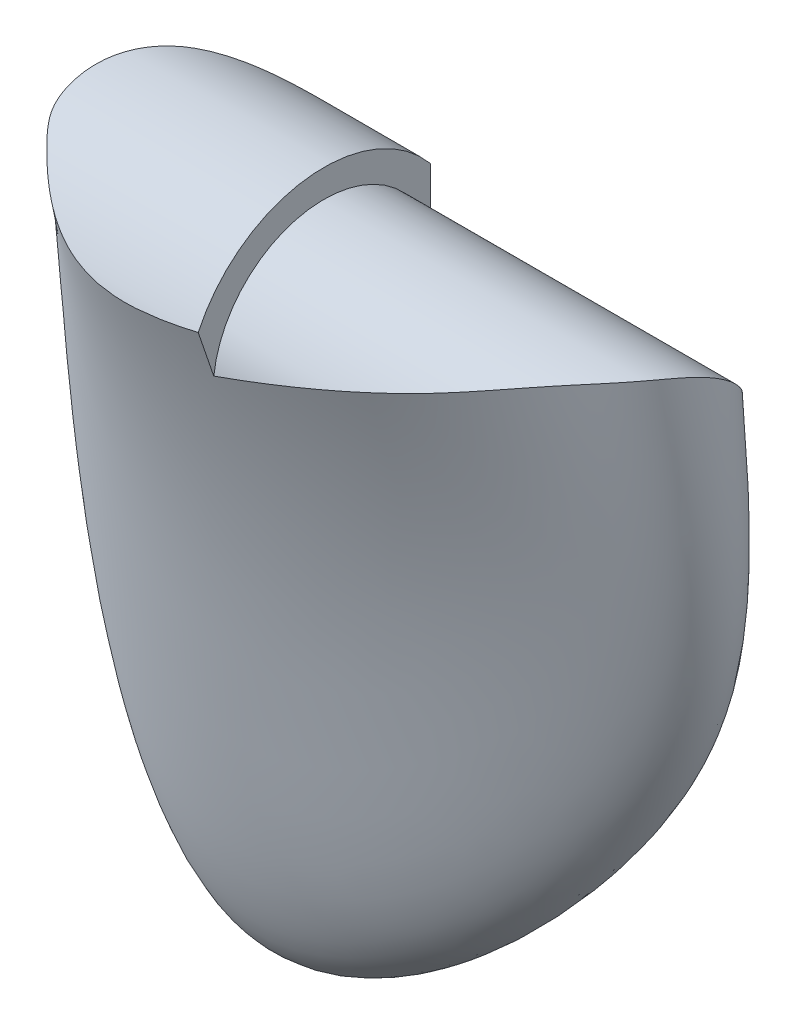
ISO-10303-21;
HEADER;
FILE_DESCRIPTION(('STEP AP214'),'2;1');
FILE_NAME('part.step','',(''),(''),'','','');
FILE_SCHEMA(('AUTOMOTIVE_DESIGN { 1 0 10303 214 1 1 1 1 }'));
ENDSEC;
DATA;
#1=APPLICATION_CONTEXT('core data for automotive mechanical design processes');
#2=APPLICATION_PROTOCOL_DEFINITION('international standard','automotive_design',2000,#1);
#3=PRODUCT_CONTEXT('',#1,'mechanical');
#4=PRODUCT('Part','Part','',(#3));
#5=PRODUCT_RELATED_PRODUCT_CATEGORY('part','',(#4));
#6=PRODUCT_DEFINITION_FORMATION('','',#4);
#7=PRODUCT_DEFINITION_CONTEXT('part definition',#1,'design');
#8=PRODUCT_DEFINITION('design','',#6,#7);
#9=PRODUCT_DEFINITION_SHAPE('','',#8);
#10=(LENGTH_UNIT() NAMED_UNIT(*) SI_UNIT(.MILLI.,.METRE.));
#11=(NAMED_UNIT(*) PLANE_ANGLE_UNIT() SI_UNIT($,.RADIAN.));
#12=(NAMED_UNIT(*) SI_UNIT($,.STERADIAN.) SOLID_ANGLE_UNIT());
#13=UNCERTAINTY_MEASURE_WITH_UNIT(LENGTH_MEASURE(1.E-05),#10,'distance_accuracy_value','');
#14=(GEOMETRIC_REPRESENTATION_CONTEXT(3) GLOBAL_UNCERTAINTY_ASSIGNED_CONTEXT((#13)) GLOBAL_UNIT_ASSIGNED_CONTEXT((#10,
#11,#12)) REPRESENTATION_CONTEXT('',''));
#15=CARTESIAN_POINT('',(0.,0.,0.));
#16=DIRECTION('',(0.,0.,1.));
#17=DIRECTION('',(1.,0.,0.));
#18=AXIS2_PLACEMENT_3D('',#15,#16,#17);
#19=CARTESIAN_POINT('',(90.2524899999999,-95.0000000000004,-945.84775686));
#20=DIRECTION('',(-1.,0.,0.));
#21=DIRECTION('',(0.,0.,-1.));
#22=AXIS2_PLACEMENT_3D('',#19,#20,#21);
#23=PLANE('',#22);
#24=CARTESIAN_POINT('',(90.2524899999999,-95.0000000000004,-945.84775686));
#25=DIRECTION('',(-1.,0.,0.));
#26=DIRECTION('',(0.,0.,1.));
#27=AXIS2_PLACEMENT_3D('',#24,#25,#26);
#28=CIRCLE('',#27,20.);
#29=CARTESIAN_POINT('',(90.2524899999999,-92.6686733749192,-925.984098683129));
#30=VERTEX_POINT('',#29);
#31=CARTESIAN_POINT('',(90.25249,-89.6259296970207,-965.112215543775));
#32=VERTEX_POINT('',#31);
#33=EDGE_CURVE('E55',#30,#32,#28,.T.);
#34=ORIENTED_EDGE('',*,*,#33,.T.);
#35=CARTESIAN_POINT('',(90.2524899999999,-69.8500000000002,-964.959969940439));
#36=CARTESIAN_POINT('',(90.2524899999999,-70.2066298722059,-964.96477196954));
#37=CARTESIAN_POINT('',(90.2524899999999,-70.5632645084139,-964.969195129855));
#38=CARTESIAN_POINT('',(90.2524899999999,-71.2765402264116,-964.977455587513));
#39=CARTESIAN_POINT('',(90.2524899999999,-71.6331813081939,-964.98129288549));
#40=CARTESIAN_POINT('',(90.2524899999999,-72.7031089951856,-964.992183793419));
#41=CARTESIAN_POINT('',(90.2524899999999,-73.4164018040494,-964.998616439392));
#42=CARTESIAN_POINT('',(90.2524899999999,-74.8429940811663,-965.01059456332));
#43=CARTESIAN_POINT('',(90.2524899999999,-75.5562935494151,-965.01614004183));
#44=CARTESIAN_POINT('',(90.2524899999999,-76.9828965102976,-965.02676215581));
#45=CARTESIAN_POINT('',(90.25249,-77.6962000029341,-965.031838790907));
#46=CARTESIAN_POINT('',(90.25249,-79.3311964211865,-965.043221944186));
#47=CARTESIAN_POINT('',(90.2524899999999,-80.252889852966,-965.049454483197));
#48=CARTESIAN_POINT('',(90.2524899999999,-82.0962770190025,-965.061826600555));
#49=CARTESIAN_POINT('',(90.2524899999999,-83.0179707532593,-965.067966178933));
#50=CARTESIAN_POINT('',(90.2524899999999,-84.8613579595957,-965.080261315281));
#51=CARTESIAN_POINT('',(90.2524899999999,-85.7830514316752,-965.086416873248));
#52=CARTESIAN_POINT('',(90.2524899999999,-87.6264396621355,-965.098767369475));
#53=CARTESIAN_POINT('',(90.2524899999999,-88.5481344205158,-965.104962307801));
#54=CARTESIAN_POINT('',(90.2524899999999,-90.39152398872,-965.117367683749));
#55=CARTESIAN_POINT('',(90.2524899999999,-91.3132187985439,-965.123578121373));
#56=CARTESIAN_POINT('',(90.2524899999999,-93.1566089734968,-965.135962610083));
#57=CARTESIAN_POINT('',(90.2524899999999,-94.0783043386259,-965.142136661156));
#58=CARTESIAN_POINT('',(90.25249,-95.,-965.148266574432));
#59=B_SPLINE_CURVE_WITH_KNOTS('',3,(#35,#36,#37,#38,#39,#40,#41,#42,#43,#44,#45,#46,#47,#48,#49,
#50,#51,#52,#53,#54,#55,#56,#57,#58),.UNSPECIFIED.,.F.,.F.,(4,2,2,2,2,2,2,2,2,2,2,4),(0.,
1.06998591410255,2.13997066916172,4.27993489285495,6.41989777801441,8.55986236437755,
11.3250058594292,14.0901484084939,16.855290488143,19.6204372188395,22.3855844165714,
25.1507325478524),.UNSPECIFIED.);
#60=CARTESIAN_POINT('',(90.25249,-78.9803625101527,-965.040755966286));
#61=VERTEX_POINT('',#60);
#62=EDGE_CURVE('E75',#61,#32,#59,.T.);
#63=ORIENTED_EDGE('',*,*,#62,.F.);
#64=CARTESIAN_POINT('',(90.2524899999999,-95.0000000000004,-945.84775686));
#65=DIRECTION('',(1.,0.,0.));
#66=DIRECTION('',(0.,0.,-1.));
#67=AXIS2_PLACEMENT_3D('',#64,#65,#66);
#68=CIRCLE('',#67,25.);
#69=CARTESIAN_POINT('',(90.25249,-84.4609710714285,-923.177757538369));
#70=VERTEX_POINT('',#69);
#71=EDGE_CURVE('E11',#61,#70,#68,.T.);
#72=ORIENTED_EDGE('',*,*,#71,.T.);
#73=CARTESIAN_POINT('',(90.2524899999999,-95.0000000000003,-926.723416295059));
#74=CARTESIAN_POINT('',(90.2524899999999,-94.4090730576185,-926.539240503663));
#75=CARTESIAN_POINT('',(90.2524899999999,-93.818840970702,-926.352835742741));
#76=CARTESIAN_POINT('',(90.2524899999999,-92.6399236996348,-925.975636559245));
#77=CARTESIAN_POINT('',(90.2524899999999,-92.0512382047963,-925.784843107726));
#78=CARTESIAN_POINT('',(90.2524899999999,-90.8754079263632,-925.398885467398));
#79=CARTESIAN_POINT('',(90.2524899999999,-90.2882629076526,-925.203721994844));
#80=CARTESIAN_POINT('',(90.2524899999999,-89.1155060581281,-924.809046963053));
#81=CARTESIAN_POINT('',(90.2524899999999,-88.5298940700074,-924.609535871228));
#82=CARTESIAN_POINT('',(90.2524899999999,-87.3601949122836,-924.206190859619));
#83=CARTESIAN_POINT('',(90.2524899999999,-86.7761076647843,-924.002357165723));
#84=CARTESIAN_POINT('',(90.2524899999999,-85.6094530471118,-923.590396828679));
#85=CARTESIAN_POINT('',(90.2524899999999,-85.0268856679166,-923.382270211079));
#86=CARTESIAN_POINT('',(90.2524899999999,-83.8632550007819,-922.961753539022));
#87=CARTESIAN_POINT('',(90.2524899999999,-83.2821917986661,-922.749363247092));
#88=CARTESIAN_POINT('',(90.2524899999999,-82.1215567310891,-922.320353362069));
#89=CARTESIAN_POINT('',(90.2524899999999,-81.5419850354548,-922.103733309553));
#90=CARTESIAN_POINT('',(90.2524899999999,-80.3843192046323,-921.66630098265));
#91=CARTESIAN_POINT('',(90.2524899999999,-79.8062253227875,-921.445488037856));
#92=CARTESIAN_POINT('',(90.2524899999999,-78.6514994079248,-920.999711359387));
#93=CARTESIAN_POINT('',(90.2524899999999,-78.0748677104331,-920.774746756542));
#94=CARTESIAN_POINT('',(90.2524899999999,-77.4990347637983,-920.54775686));
#95=B_SPLINE_CURVE_WITH_KNOTS('',3,(#73,#74,#75,#76,#77,#78,#79,#80,#81,#82,#83,#84,#85,#86,#87,
#88,#89,#90,#91,#92,#93,#94),.UNSPECIFIED.,.F.,.F.,(4,2,2,2,2,2,2,2,2,2,4),(0.,1.85688482362838,
3.7133626664617,5.56953842523697,7.42551560213756,9.28139602830066,11.1372654126579,
12.9932384510719,14.8494142123222,16.7058893007433,18.5627575619089),.UNSPECIFIED.);
#96=EDGE_CURVE('E73',#30,#70,#95,.T.);
#97=ORIENTED_EDGE('',*,*,#96,.F.);
#98=EDGE_LOOP('',(#34,#63,#72,#97));
#99=FACE_BOUND('',#98,.T.);
#100=ADVANCED_FACE('F38',(#99),#23,.F.);
#101=CARTESIAN_POINT('',(90.2524899999999,-95.0000000000004,-945.84775686));
#102=DIRECTION('',(1.,0.,0.));
#103=DIRECTION('',(0.,0.,1.));
#104=AXIS2_PLACEMENT_3D('',#101,#102,#103);
#105=CYLINDRICAL_SURFACE('',#104,20.);
#106=CARTESIAN_POINT('',(90.25249,-92.6686733749414,-925.984098683136));
#107=CARTESIAN_POINT('',(90.6635311227348,-92.5355579964911,-925.999718818905));
#108=CARTESIAN_POINT('',(91.0743375881091,-92.4018872980755,-926.016766769768));
#109=CARTESIAN_POINT('',(91.8955439579554,-92.1336997436797,-926.053752425881));
#110=CARTESIAN_POINT('',(92.3059438625495,-91.9991828879536,-926.073690130264));
#111=CARTESIAN_POINT('',(93.1265349789843,-91.7295231013379,-926.116496462352));
#112=CARTESIAN_POINT('',(93.5367260778568,-91.5943799791575,-926.13936605148));
#113=CARTESIAN_POINT('',(94.3567920065511,-91.3236703575141,-926.18806428908));
#114=CARTESIAN_POINT('',(94.766666836324,-91.1881038579859,-926.21389293801));
#115=CARTESIAN_POINT('',(95.9959993039708,-90.7808962384895,-926.295880716373));
#116=CARTESIAN_POINT('',(96.8150109238682,-90.5087977050866,-926.356533669636));
#117=CARTESIAN_POINT('',(98.451834553238,-89.9638368124531,-926.490179464405));
#118=CARTESIAN_POINT('',(99.2696464753107,-89.6909744014119,-926.563173163904));
#119=CARTESIAN_POINT('',(100.904865455493,-89.144276933915,-926.722076466842));
#120=CARTESIAN_POINT('',(101.722270658625,-88.8704410798775,-926.808002466977));
#121=CARTESIAN_POINT('',(103.355280202844,-88.3221442518088,-926.993314738082));
#122=CARTESIAN_POINT('',(104.170884671523,-88.0476833250633,-927.092700022092));
#123=CARTESIAN_POINT('',(105.799919498908,-87.4980674621426,-927.305700140769));
#124=CARTESIAN_POINT('',(106.613350050536,-87.2229125920685,-927.41931366683));
#125=CARTESIAN_POINT('',(108.237641258128,-86.6718365907117,-927.661709805268));
#126=CARTESIAN_POINT('',(109.048502060556,-86.3959155048449,-927.790491536561));
#127=CARTESIAN_POINT('',(110.636748875987,-85.8536794547082,-928.059195988456));
#128=CARTESIAN_POINT('',(111.414246390517,-85.587393705691,-928.198517145109));
#129=CARTESIAN_POINT('',(112.965944436853,-85.0541487834498,-928.493423574403));
#130=CARTESIAN_POINT('',(113.740144909998,-84.7871895983775,-928.649009135171));
#131=CARTESIAN_POINT('',(115.284708342912,-84.2527327717988,-928.977821813771));
#132=CARTESIAN_POINT('',(116.055070906235,-83.9852350785152,-929.151050716049));
#133=CARTESIAN_POINT('',(117.59237539412,-83.4495725048141,-929.51701848447));
#134=CARTESIAN_POINT('',(118.359309891867,-83.1814072411057,-929.709788064018));
#135=CARTESIAN_POINT('',(119.887604393568,-82.6452421065621,-930.116475300274));
#136=CARTESIAN_POINT('',(120.648964660649,-82.3772422284742,-930.330391951745));
#137=CARTESIAN_POINT('',(121.785910698115,-81.9757980723619,-930.668799622654));
#138=CARTESIAN_POINT('',(122.164025010344,-81.8420825864516,-930.784518117041));
#139=CARTESIAN_POINT('',(122.918402118602,-81.574908917752,-931.022140500776));
#140=CARTESIAN_POINT('',(123.294664909728,-81.4414507356444,-931.144044406491));
#141=CARTESIAN_POINT('',(124.07701410087,-81.1635717412403,-931.405020988267));
#142=CARTESIAN_POINT('',(124.482919056129,-81.0191826376936,-931.544672466946));
#143=CARTESIAN_POINT('',(125.291974626453,-80.7309142138433,-931.832243615194));
#144=CARTESIAN_POINT('',(125.695125244297,-80.5870348930257,-931.980163276422));
#145=CARTESIAN_POINT('',(126.498644858149,-80.3002533859252,-932.284528067143));
#146=CARTESIAN_POINT('',(126.899013308511,-80.1573513914009,-932.440974818594));
#147=CARTESIAN_POINT('',(127.696875949449,-79.8731779570625,-932.762448971125));
#148=CARTESIAN_POINT('',(128.094370131324,-79.7319065221835,-932.927476398168));
#149=CARTESIAN_POINT('',(128.886633241617,-79.4515638752171,-933.266243203485));
#150=CARTESIAN_POINT('',(129.28140095601,-79.312493611613,-933.439986209706));
#151=CARTESIAN_POINT('',(130.068035260979,-79.0372723816108,-933.796118537109));
#152=CARTESIAN_POINT('',(130.459901854264,-78.9011214124851,-933.978507850211));
#153=CARTESIAN_POINT('',(131.631840309203,-78.4978119999625,-934.538924883778));
#154=CARTESIAN_POINT('',(132.407610137025,-78.2360259218747,-934.929927672402));
#155=CARTESIAN_POINT('',(133.946023655253,-77.7327002518939,-935.744824816598));
#156=CARTESIAN_POINT('',(134.708692642835,-77.4911170415077,-936.168644295762));
#157=CARTESIAN_POINT('',(135.843986526499,-77.1472357691208,-936.828864300271));
#158=CARTESIAN_POINT('',(136.220975836606,-77.0356882958576,-937.053025532827));
#159=CARTESIAN_POINT('',(136.971960416417,-76.8193351058695,-937.509459654161));
#160=CARTESIAN_POINT('',(137.345955791475,-76.714529150995,-937.741732255951));
#161=CARTESIAN_POINT('',(138.090426873609,-76.5123048667041,-938.214205114275));
#162=CARTESIAN_POINT('',(138.460905458457,-76.4148799404078,-938.454398009619));
#163=CARTESIAN_POINT('',(139.198316444382,-76.2278376510004,-938.943093082849));
#164=CARTESIAN_POINT('',(139.565249025899,-76.1382198887407,-939.191594835037));
#165=CARTESIAN_POINT('',(140.294619441816,-75.9673727478209,-939.697128084372));
#166=CARTESIAN_POINT('',(140.657061385291,-75.8861351112783,-939.954150848219));
#167=CARTESIAN_POINT('',(141.376799616757,-75.7324585746518,-940.477808840564));
#168=CARTESIAN_POINT('',(141.734096421666,-75.6600187851557,-940.744443093855));
#169=CARTESIAN_POINT('',(142.379854787743,-75.5363927571754,-941.241078560729));
#170=CARTESIAN_POINT('',(142.669395775193,-75.4837074134831,-941.469300168076));
#171=CARTESIAN_POINT('',(143.242410492634,-75.3851223784806,-941.934560028497));
#172=CARTESIAN_POINT('',(143.52588554564,-75.3392211943348,-942.171596327511));
#173=CARTESIAN_POINT('',(144.085295039925,-75.2548228155514,-942.655829411727));
#174=CARTESIAN_POINT('',(144.361227935303,-75.2163271291835,-942.903028254307));
#175=CARTESIAN_POINT('',(144.902341141262,-75.1477805566832,-943.407688181667));
#176=CARTESIAN_POINT('',(145.167564319596,-75.1176923811281,-943.665097976697));
#177=CARTESIAN_POINT('',(145.686291507559,-75.0668660311124,-944.192367909797));
#178=CARTESIAN_POINT('',(145.93979641298,-75.0461271408898,-944.462227093024));
#179=CARTESIAN_POINT('',(146.432513045849,-75.0154198362557,-945.015186048759));
#180=CARTESIAN_POINT('',(146.671730355832,-75.0054471888405,-945.298280571771));
#181=CARTESIAN_POINT('',(147.069306377844,-74.9989667588482,-945.797580491356));
#182=CARTESIAN_POINT('',(147.231685121428,-74.999490890722,-946.010552785716));
#183=CARTESIAN_POINT('',(147.546755232767,-75.0077004815073,-946.443418621399));
#184=CARTESIAN_POINT('',(147.699447198496,-75.0153854979107,-946.663311734238));
#185=CARTESIAN_POINT('',(147.994322205277,-75.0385969709978,-947.109624284482));
#186=CARTESIAN_POINT('',(148.136505956601,-75.0541228971426,-947.33604327935));
#187=CARTESIAN_POINT('',(148.409766337001,-75.093675351791,-947.79487661681));
#188=CARTESIAN_POINT('',(148.540839276792,-75.1177046902081,-948.02729291762));
#189=CARTESIAN_POINT('',(148.791376386913,-75.1748590513028,-948.497248217397));
#190=CARTESIAN_POINT('',(148.910839453176,-75.2079849378924,-948.734787700944));
#191=CARTESIAN_POINT('',(149.137876410877,-75.2838240968831,-949.213952918212));
#192=CARTESIAN_POINT('',(149.245450857479,-75.3265369213195,-949.455578460516));
#193=CARTESIAN_POINT('',(149.4996750274,-75.4459101592727,-950.063900144914));
#194=CARTESIAN_POINT('',(149.638853024582,-75.5288512671231,-950.432528075365));
#195=CARTESIAN_POINT('',(149.891461669618,-75.718081077456,-951.172564208347));
#196=CARTESIAN_POINT('',(150.004890234315,-75.8243716675697,-951.543972633315));
#197=CARTESIAN_POINT('',(150.207232354833,-76.0606608677694,-952.286171497451));
#198=CARTESIAN_POINT('',(150.296131590564,-76.1906732532535,-952.656961450552));
#199=CARTESIAN_POINT('',(150.450324231503,-76.474226091163,-953.394396342024));
#200=CARTESIAN_POINT('',(150.515618572116,-76.6277656109215,-953.761041444087));
#201=CARTESIAN_POINT('',(150.622879478274,-76.9562982193085,-954.483780631587));
#202=CARTESIAN_POINT('',(150.665062217891,-77.1310731421328,-954.839941935336));
#203=CARTESIAN_POINT('',(150.727585423323,-77.5024046550797,-955.542709266892));
#204=CARTESIAN_POINT('',(150.747925223365,-77.6989619089256,-955.889315003132));
#205=CARTESIAN_POINT('',(150.767099139817,-78.112912483137,-956.570881897226));
#206=CARTESIAN_POINT('',(150.765913961641,-78.3303243235307,-956.905832338061));
#207=CARTESIAN_POINT('',(150.74212726625,-78.7844228340695,-957.561597100685));
#208=CARTESIAN_POINT('',(150.719527764473,-79.0211076883921,-957.882412749817));
#209=CARTESIAN_POINT('',(150.662980919673,-79.4375848237053,-958.41310865296));
#210=CARTESIAN_POINT('',(150.634548628781,-79.612879469571,-958.627142504428));
#211=CARTESIAN_POINT('',(150.567188643868,-79.9713576718118,-959.046850188065));
#212=CARTESIAN_POINT('',(150.528259566515,-80.154542265299,-959.252522914239));
#213=CARTESIAN_POINT('',(150.439767996975,-80.5281226647393,-959.655007717417));
#214=CARTESIAN_POINT('',(150.3902013278,-80.7185212791185,-959.851816276957));
#215=CARTESIAN_POINT('',(150.307795007485,-81.0087114933836,-960.139796706823));
#216=CARTESIAN_POINT('',(150.279002530875,-81.1061491479024,-960.234531967725));
#217=CARTESIAN_POINT('',(150.218687189713,-81.3024910194077,-960.421590561192));
#218=CARTESIAN_POINT('',(150.187164303176,-81.4013952481971,-960.513913874329));
#219=CARTESIAN_POINT('',(150.121389186911,-81.6005320185711,-960.696072036306));
#220=CARTESIAN_POINT('',(150.087137596468,-81.7007642444694,-960.785907461405));
#221=CARTESIAN_POINT('',(150.015740185983,-81.902436589316,-960.963041898801));
#222=CARTESIAN_POINT('',(149.97859434454,-82.0038767171906,-961.050340892337));
#223=CARTESIAN_POINT('',(149.901007116357,-82.207701511813,-961.222244344808));
#224=CARTESIAN_POINT('',(149.860567115786,-82.3100857653566,-961.306849916493));
#225=CARTESIAN_POINT('',(149.776037688339,-82.5155931063954,-961.473283082691));
#226=CARTESIAN_POINT('',(149.731948457898,-82.6187161538491,-961.555110826399));
#227=CARTESIAN_POINT('',(149.622323656608,-82.8646231270189,-961.746348553052));
#228=CARTESIAN_POINT('',(149.554992776226,-83.0076263671659,-961.854458868066));
#229=CARTESIAN_POINT('',(149.412070920839,-83.2937329095019,-962.064872562841));
#230=CARTESIAN_POINT('',(149.336481685192,-83.4368361843372,-962.167177158521));
#231=CARTESIAN_POINT('',(149.176531944157,-83.7223103016652,-962.365745270951));
#232=CARTESIAN_POINT('',(149.092172620834,-83.8646812401574,-962.462009599035));
#233=CARTESIAN_POINT('',(148.914683659327,-84.1473739384421,-962.64802615562));
#234=CARTESIAN_POINT('',(148.821583199198,-84.28770082808,-962.737798394805));
#235=CARTESIAN_POINT('',(148.626321770468,-84.5659490632601,-962.91109331743));
#236=CARTESIAN_POINT('',(148.52415899609,-84.7038699227902,-962.994614749179));
#237=CARTESIAN_POINT('',(148.310991299676,-84.9764723358254,-963.155383574024));
#238=CARTESIAN_POINT('',(148.199986645737,-85.1111539873863,-963.232631157207));
#239=CARTESIAN_POINT('',(147.911979060291,-85.4428173820277,-963.417963889115));
#240=CARTESIAN_POINT('',(147.729671365305,-85.6373701578766,-963.522214543709));
#241=CARTESIAN_POINT('',(147.347858764863,-86.0158130135088,-963.717557675467));
#242=CARTESIAN_POINT('',(147.148354015749,-86.1997031902026,-963.808650272233));
#243=CARTESIAN_POINT('',(146.733705922363,-86.5562852466233,-963.979024170422));
#244=CARTESIAN_POINT('',(146.518516553656,-86.7289411048479,-964.058268443368));
#245=CARTESIAN_POINT('',(146.075213176167,-87.0619623971097,-964.205881985458));
#246=CARTESIAN_POINT('',(145.847095002474,-87.2223238310044,-964.274247722853));
#247=CARTESIAN_POINT('',(145.435115946054,-87.4942716734953,-964.386372490704));
#248=CARTESIAN_POINT('',(145.253491446325,-87.6084477454339,-964.432133919768));
#249=CARTESIAN_POINT('',(144.884796180693,-87.8295858392077,-964.518569158608));
#250=CARTESIAN_POINT('',(144.697726576614,-87.9365493840594,-964.559244044031));
#251=CARTESIAN_POINT('',(144.129186165041,-88.2469632832681,-964.674477526288));
#252=CARTESIAN_POINT('',(143.740511587928,-88.4398533864326,-964.742211195644));
#253=CARTESIAN_POINT('',(142.948644329121,-88.7989069912318,-964.863073866426));
#254=CARTESIAN_POINT('',(142.545440645982,-88.965049696209,-964.91619152614));
#255=CARTESIAN_POINT('',(141.72826730568,-89.2720258021999,-965.010639293529));
#256=CARTESIAN_POINT('',(141.314298482625,-89.4128611574366,-965.051970311507));
#257=CARTESIAN_POINT('',(140.427484276306,-89.686395679876,-965.129567758491));
#258=CARTESIAN_POINT('',(139.953592173192,-89.816031652117,-965.16461027004));
#259=CARTESIAN_POINT('',(138.998261459276,-90.0475292095409,-965.225251894499));
#260=CARTESIAN_POINT('',(138.516818610963,-90.1493745623184,-965.250845491397));
#261=CARTESIAN_POINT('',(137.548852882947,-90.3274122619264,-965.294486900051));
#262=CARTESIAN_POINT('',(137.062329249849,-90.4036007469368,-965.312533575957));
#263=CARTESIAN_POINT('',(136.085025927576,-90.5329194978045,-965.342617394096));
#264=CARTESIAN_POINT('',(135.594239325837,-90.5859997172931,-965.354641501431));
#265=CARTESIAN_POINT('',(134.610957283808,-90.6716716128599,-965.373828671268));
#266=CARTESIAN_POINT('',(134.118462307055,-90.704268466909,-965.380992962315));
#267=CARTESIAN_POINT('',(133.132647605948,-90.7520674202698,-965.391442380672));
#268=CARTESIAN_POINT('',(132.639327913254,-90.7672701726388,-965.394727653619));
#269=CARTESIAN_POINT('',(131.563082499905,-90.7849343410501,-965.398544998934));
#270=CARTESIAN_POINT('',(130.980113924572,-90.7845886103417,-965.398470484892));
#271=CARTESIAN_POINT('',(129.814400505147,-90.7692009727826,-965.395144590421));
#272=CARTESIAN_POINT('',(129.231655673765,-90.7541583277486,-965.391893050419));
#273=CARTESIAN_POINT('',(128.066492173783,-90.7140865927244,-965.383144147495));
#274=CARTESIAN_POINT('',(127.484073543907,-90.6890564979212,-965.377646558603));
#275=CARTESIAN_POINT('',(126.320274300529,-90.6331496582555,-965.365221668733));
#276=CARTESIAN_POINT('',(125.738893298597,-90.6022802475065,-965.358296160234));
#277=CARTESIAN_POINT('',(124.576352920891,-90.5380269136872,-965.343702184779));
#278=CARTESIAN_POINT('',(123.995193527028,-90.5046432887163,-965.33603380587));
#279=CARTESIAN_POINT('',(122.832893873305,-90.4378579346278,-965.320508082167));
#280=CARTESIAN_POINT('',(122.251753613349,-90.4044562060189,-965.312650742438));
#281=CARTESIAN_POINT('',(121.235187663889,-90.3473891660937,-965.299076857092));
#282=CARTESIAN_POINT('',(120.799781834126,-90.3233834800055,-965.293317767613));
#283=CARTESIAN_POINT('',(119.928902861579,-90.2765773290693,-965.28200129162));
#284=CARTESIAN_POINT('',(119.493429718819,-90.253776863794,-965.276443905036));
#285=CARTESIAN_POINT('',(118.186877326053,-90.1874242143431,-965.260154898527));
#286=CARTESIAN_POINT('',(117.315688282141,-90.1459220991129,-965.249806748025));
#287=CARTESIAN_POINT('',(115.572915516758,-90.0678157962583,-965.230099116539));
#288=CARTESIAN_POINT('',(114.701331751665,-90.0312125473016,-965.220739825101));
#289=CARTESIAN_POINT('',(112.958029416636,-89.9613433356717,-965.202684531089));
#290=CARTESIAN_POINT('',(112.086310847398,-89.9280773562663,-965.193988525189));
#291=CARTESIAN_POINT('',(110.341852582347,-89.8645241827808,-965.177215449291));
#292=CARTESIAN_POINT('',(109.469112766151,-89.8342401177548,-965.169139031375));
#293=CARTESIAN_POINT('',(107.723520295486,-89.7768470794473,-965.153702978009));
#294=CARTESIAN_POINT('',(106.850667640802,-89.7497381123139,-965.146343343946));
#295=CARTESIAN_POINT('',(105.104897923506,-89.6990868266119,-965.13249196493));
#296=CARTESIAN_POINT('',(104.231980866783,-89.6755443185271,-965.126000173862));
#297=CARTESIAN_POINT('',(102.486034498289,-89.6327687759917,-965.114134845551));
#298=CARTESIAN_POINT('',(101.613005187025,-89.6135357226851,-965.108761303414));
#299=CARTESIAN_POINT('',(100.303104280058,-89.5889140783405,-965.101853108372));
#300=CARTESIAN_POINT('',(99.8662753777302,-89.5814098455768,-965.099741919649));
#301=CARTESIAN_POINT('',(98.9925888315149,-89.5680720613648,-965.0959829311));
#302=CARTESIAN_POINT('',(98.5557311875809,-89.5622385126701,-965.094335132037));
#303=CARTESIAN_POINT('',(97.6820045076329,-89.5525655111478,-965.091599585402));
#304=CARTESIAN_POINT('',(97.2451354723335,-89.5487259995886,-965.090511821335));
#305=CARTESIAN_POINT('',(96.3713815851254,-89.5434686988315,-965.089021744606));
#306=CARTESIAN_POINT('',(95.9344967332748,-89.5420509015041,-965.088619429644));
#307=CARTESIAN_POINT('',(95.2790406247445,-89.5421656367957,-965.088651945091));
#308=CARTESIAN_POINT('',(95.0604689700535,-89.5425779086129,-965.088768910609));
#309=CARTESIAN_POINT('',(94.6233290011027,-89.5442376918655,-965.089239612401));
#310=CARTESIAN_POINT('',(94.4047606868416,-89.545485202972,-965.089593348583));
#311=CARTESIAN_POINT('',(93.9676310428159,-89.5489137183999,-965.090564908087));
#312=CARTESIAN_POINT('',(93.7490697130766,-89.5510947257889,-965.091182732277));
#313=CARTESIAN_POINT('',(93.3119610826098,-89.556491087357,-965.092709924658));
#314=CARTESIAN_POINT('',(93.0934137818721,-89.5597064407614,-965.093619292632));
#315=CARTESIAN_POINT('',(92.4377415956131,-89.5707672050055,-965.096743580152));
#316=CARTESIAN_POINT('',(92.0006422412286,-89.5800268598493,-965.099354552192));
#317=CARTESIAN_POINT('',(91.3450487858757,-89.595965608733,-965.103832327025));
#318=CARTESIAN_POINT('',(91.1265261887377,-89.6016200911084,-965.105418477481));
#319=CARTESIAN_POINT('',(90.6894973254501,-89.6134373521117,-965.108727280155));
#320=CARTESIAN_POINT('',(90.4709910591912,-89.6196001269595,-965.110449931356));
#321=CARTESIAN_POINT('',(90.25249,-89.6259296970436,-965.112215543776));
#322=B_SPLINE_CURVE_WITH_KNOTS('',3,(#106,#107,#108,#109,#110,#111,#112,#113,#114,#115,#116,
#117,#118,#119,#120,#121,#122,#123,#124,#125,#126,#127,#128,#129,#130,#131,#132,#133,#134,#135,
#136,#137,#138,#139,#140,#141,#142,#143,#144,#145,#146,#147,#148,#149,#150,#151,#152,#153,#154,
#155,#156,#157,#158,#159,#160,#161,#162,#163,#164,#165,#166,#167,#168,#169,#170,#171,#172,#173,
#174,#175,#176,#177,#178,#179,#180,#181,#182,#183,#184,#185,#186,#187,#188,#189,#190,#191,#192,
#193,#194,#195,#196,#197,#198,#199,#200,#201,#202,#203,#204,#205,#206,#207,#208,#209,#210,#211,
#212,#213,#214,#215,#216,#217,#218,#219,#220,#221,#222,#223,#224,#225,#226,#227,#228,#229,#230,
#231,#232,#233,#234,#235,#236,#237,#238,#239,#240,#241,#242,#243,#244,#245,#246,#247,#248,#249,
#250,#251,#252,#253,#254,#255,#256,#257,#258,#259,#260,#261,#262,#263,#264,#265,#266,#267,#268,
#269,#270,#271,#272,#273,#274,#275,#276,#277,#278,#279,#280,#281,#282,#283,#284,#285,#286,#287,
#288,#289,#290,#291,#292,#293,#294,#295,#296,#297,#298,#299,#300,#301,#302,#303,#304,#305,#306,
#307,#308,#309,#310,#311,#312,#313,#314,#315,#316,#317,#318,#319,#320,#321),.UNSPECIFIED.,.F.,
.F.,(4,2,2,2,2,2,2,2,2,2,2,2,2,2,2,2,2,2,2,2,2,2,2,2,2,2,2,2,2,2,2,2,2,2,2,2,2,2,2,2,2,2,2,2,2,
2,2,2,2,2,2,2,2,2,2,2,2,2,2,2,2,2,2,2,2,2,2,2,2,2,2,2,2,2,2,2,2,2,2,2,2,2,2,2,2,2,2,2,2,2,2,2,2,
2,2,2,2,2,2,2,2,2,2,2,2,2,2,4),(0.,1.29701857076175,2.59403675208982,3.89148134419765,
5.18892613645482,7.78430266133752,10.3798597048058,12.9787357850441,15.577421394392,
18.1758681715148,20.7741640853888,23.274689689254,25.7752595979955,28.2760826658373,
30.7808992574328,33.2855968385664,34.5378213374255,35.7900491500442,37.1486411914933,
38.5072318624709,39.8660818622384,41.2249359735789,42.584360492678,43.9437837415196,
46.6648288228504,49.3798386761598,50.7374136643237,52.0949406686765,53.4512396924068,
54.8074693333514,56.1623494986227,57.5170925790319,58.6341662111586,59.7509936671726,
60.8680483459556,61.9800669870218,63.0920004797848,64.2034966301187,65.006616825486,
65.809687395211,66.6127036341148,67.4159854742028,68.219343629509,69.0226642544683,
70.2289990941537,71.4354314929118,72.6425667174044,73.8496541008022,75.0452493943149,
76.2408811285039,77.4375846572446,78.6341755677594,79.468112544473,80.3021594764629,
81.1365345089797,81.5532392904003,81.9699474272761,82.386558222541,82.8031720984897,
83.2196115615805,83.6360286225298,84.2102619180148,84.7843745019099,85.3584098047307,
85.9305928329411,86.5028901327495,87.0751700863693,87.9328656636491,88.7905534442692,
89.6508680349224,90.5114613619718,91.1692830715078,91.8269654358077,93.1427975625532,
94.4596478859012,95.7763964788838,97.2529932465678,98.7304506521017,100.208130342253,
101.688994563892,103.169484288475,104.649918426599,106.39854703639,108.147263479229,
109.896155900554,111.642866145219,113.389369615085,115.135826326116,116.444140200263,
117.752453610546,120.369150061177,122.986347179276,125.603531174797,128.223432865825,
130.843339629786,133.463107126998,136.082863161241,137.393555886668,138.704250772345,
140.014907051173,141.325558930253,141.981273750747,142.636988313008,143.292705030101,
143.948421256106,145.260021153087,145.91582535201,146.571624674096),.UNSPECIFIED.);
#323=EDGE_CURVE('E71',#30,#32,#322,.T.);
#324=ORIENTED_EDGE('',*,*,#323,.T.);
#325=ORIENTED_EDGE('',*,*,#33,.F.);
#326=EDGE_LOOP('',(#324,#325));
#327=FACE_BOUND('',#326,.T.);
#328=ADVANCED_FACE('F82',(#327),#105,.T.);
#329=CARTESIAN_POINT('',(90.2524899999999,-95.0000000000004,-945.84775686));
#330=DIRECTION('',(-1.,0.,0.));
#331=DIRECTION('',(0.,0.,-1.));
#332=AXIS2_PLACEMENT_3D('',#329,#330,#331);
#333=CYLINDRICAL_SURFACE('',#332,25.);
#334=ORIENTED_EDGE('',*,*,#71,.F.);
#335=CARTESIAN_POINT('',(90.25249,-84.4609710714285,-923.177757538369));
#336=CARTESIAN_POINT('',(89.7128827588307,-84.5551261003442,-923.133982125619));
#337=CARTESIAN_POINT('',(89.1725739627746,-84.6463180792073,-923.092305398489));
#338=CARTESIAN_POINT('',(88.0888589561047,-84.8220652604737,-923.013157683811));
#339=CARTESIAN_POINT('',(87.5454483298646,-84.9065991935946,-922.975700022321));
#340=CARTESIAN_POINT('',(86.4561634200324,-85.0678750009713,-922.905205587746));
#341=CARTESIAN_POINT('',(85.9102864529171,-85.1446024193347,-922.872176981565));
#342=CARTESIAN_POINT('',(84.8166506484701,-85.2887580119133,-922.810875209117));
#343=CARTESIAN_POINT('',(84.2688907811956,-85.3561798049834,-922.782605303145));
#344=CARTESIAN_POINT('',(83.15248402018,-85.4820291456071,-922.730381751493));
#345=CARTESIAN_POINT('',(82.5837824199574,-85.5400551459705,-922.706615713491));
#346=CARTESIAN_POINT('',(81.4452154688329,-85.6412542444701,-922.665503444781));
#347=CARTESIAN_POINT('',(80.8753512723461,-85.6844381677484,-922.648152534465));
#348=CARTESIAN_POINT('',(79.7348186160803,-85.7525632326837,-922.620913087826));
#349=CARTESIAN_POINT('',(79.1641512986728,-85.7775203272881,-922.611018025566));
#350=CARTESIAN_POINT('',(78.0222964701328,-85.8052922517041,-922.600012181542));
#351=CARTESIAN_POINT('',(77.4511091883487,-85.8081142753321,-922.598898545848));
#352=CARTESIAN_POINT('',(76.4688551484549,-85.790082777634,-922.606038864231));
#353=CARTESIAN_POINT('',(76.0576545705893,-85.7756259158641,-922.611761652849));
#354=CARTESIAN_POINT('',(75.2361737176075,-85.7311101500386,-922.629482198097));
#355=CARTESIAN_POINT('',(74.8258935062258,-85.70105019706,-922.641480376591));
#356=CARTESIAN_POINT('',(74.0071923079342,-85.6235310013556,-922.672692994224));
#357=CARTESIAN_POINT('',(73.5987714655729,-85.5760704285131,-922.691907985023));
#358=CARTESIAN_POINT('',(72.7888104045505,-85.4625870914609,-922.73841913102));
#359=CARTESIAN_POINT('',(72.3872414867742,-85.3967401213166,-922.765638877065));
#360=CARTESIAN_POINT('',(71.5886348798089,-85.2449180433007,-922.829391099437));
#361=CARTESIAN_POINT('',(71.1915972177493,-85.1589428149839,-922.865923631489));
#362=CARTESIAN_POINT('',(70.4038092202921,-84.9659192244181,-922.949541145124));
#363=CARTESIAN_POINT('',(70.0130583569938,-84.8588726416201,-922.996625235687));
#364=CARTESIAN_POINT('',(69.2334551867823,-84.6214726062286,-923.103452605969));
#365=CARTESIAN_POINT('',(68.8447341898696,-84.4907724065897,-923.163387075411));
#366=CARTESIAN_POINT('',(68.0775545027505,-84.2077000496449,-923.296687834998));
#367=CARTESIAN_POINT('',(67.699097093981,-84.0553252008974,-923.370055793567));
#368=CARTESIAN_POINT('',(66.9542540706919,-83.7302676392544,-923.531260595212));
#369=CARTESIAN_POINT('',(66.5878665120798,-83.5575882174961,-923.619095094351));
#370=CARTESIAN_POINT('',(65.8679303372356,-83.1938116898149,-923.810149371151));
#371=CARTESIAN_POINT('',(65.5143976251247,-83.0026927709758,-923.913387451248));
#372=CARTESIAN_POINT('',(64.821268155916,-82.604936905459,-924.135680021821));
#373=CARTESIAN_POINT('',(64.4816734520159,-82.3982976850948,-924.254736831674));
#374=CARTESIAN_POINT('',(63.8165502501916,-81.9726650418339,-924.508825518101));
#375=CARTESIAN_POINT('',(63.4910217027664,-81.7536716624199,-924.643857338449));
#376=CARTESIAN_POINT('',(62.7599946832014,-81.2409791489138,-924.971767022206));
#377=CARTESIAN_POINT('',(62.3590475142426,-80.9442091149328,-925.16999446954));
#378=CARTESIAN_POINT('',(61.5775558089363,-80.3421652520292,-925.592308979924));
#379=CARTESIAN_POINT('',(61.1970190306481,-80.0368882556442,-925.8164057754));
#380=CARTESIAN_POINT('',(60.4533448488957,-79.4239519474858,-926.289213793023));
#381=CARTESIAN_POINT('',(60.0902141963799,-79.1162917642825,-926.537934452684));
#382=CARTESIAN_POINT('',(59.3754156342968,-78.5017654031998,-927.060206826558));
#383=CARTESIAN_POINT('',(59.0238541664568,-78.1949225006592,-927.333930839359));
#384=CARTESIAN_POINT('',(58.3316294230704,-77.5890565023957,-927.902511211991));
#385=CARTESIAN_POINT('',(57.9909617549395,-77.2900302639569,-928.197358894912));
#386=CARTESIAN_POINT('',(57.3193735910124,-76.7023641786275,-928.80734419462));
#387=CARTESIAN_POINT('',(56.9884481448995,-76.413719039662,-929.122471238131));
#388=CARTESIAN_POINT('',(56.5385021280695,-76.0250822357598,-929.569586564387));
#389=CARTESIAN_POINT('',(56.4159384539983,-75.9196181974922,-929.693327035969));
#390=CARTESIAN_POINT('',(56.1718404951842,-75.7106325603802,-929.943453972098));
#391=CARTESIAN_POINT('',(56.0503062497786,-75.6071110355826,-930.069840537126));
#392=CARTESIAN_POINT('',(55.8082296396309,-75.4020501899377,-930.325281944254));
#393=CARTESIAN_POINT('',(55.6876877141648,-75.3005117222365,-930.454337887657));
#394=CARTESIAN_POINT('',(55.4483462078034,-75.0991050511835,-930.7156185348));
#395=CARTESIAN_POINT('',(55.3295482395686,-74.9992383830981,-930.847845906095));
#396=CARTESIAN_POINT('',(55.0962017990909,-74.8020199970916,-931.114501563023));
#397=CARTESIAN_POINT('',(54.9816210559738,-74.7046527181069,-931.248889946575));
#398=CARTESIAN_POINT('',(54.7569516733012,-74.510950147833,-931.522015730921));
#399=CARTESIAN_POINT('',(54.6468614351787,-74.4146144984631,-931.660751552424));
#400=CARTESIAN_POINT('',(54.4332546964876,-74.2226607878631,-931.943393309911));
#401=CARTESIAN_POINT('',(54.3297308659601,-74.1270420354373,-932.087293189908));
#402=CARTESIAN_POINT('',(54.1314656600762,-73.9362284624569,-932.381198682301));
#403=CARTESIAN_POINT('',(54.0367191595635,-73.8410334258027,-932.531200657046));
#404=CARTESIAN_POINT('',(53.8804768854192,-73.674936157671,-932.799389182777));
#405=CARTESIAN_POINT('',(53.8166005497806,-73.6039276480008,-932.916122545881));
#406=CARTESIAN_POINT('',(53.6955465028616,-73.4623206104068,-933.15336999656));
#407=CARTESIAN_POINT('',(53.6383725089564,-73.3917223304491,-933.273886135673));
#408=CARTESIAN_POINT('',(53.5311051583679,-73.2512502638883,-933.51845159121));
#409=CARTESIAN_POINT('',(53.4810122200928,-73.1813765203229,-933.642501115898));
#410=CARTESIAN_POINT('',(53.3879282834202,-73.0427115491278,-933.893759001138));
#411=CARTESIAN_POINT('',(53.3449347540016,-72.9739199436512,-934.020966217251));
#412=CARTESIAN_POINT('',(53.2655574781653,-72.8373996623494,-934.27881016632));
#413=CARTESIAN_POINT('',(53.2292061127346,-72.7696775910914,-934.409460323949));
#414=CARTESIAN_POINT('',(53.1628767208953,-72.6359235531386,-934.673234228745));
#415=CARTESIAN_POINT('',(53.1328995694089,-72.5698918195515,-934.806358312758));
#416=CARTESIAN_POINT('',(53.0787413212721,-72.4397468323752,-935.074770571201));
#417=CARTESIAN_POINT('',(53.0545627220375,-72.3756344157956,-935.210059651423));
#418=CARTESIAN_POINT('',(53.0113741189495,-72.249539796563,-935.482473690942));
#419=CARTESIAN_POINT('',(52.9923653335404,-72.1875580990891,-935.61959907505));
#420=CARTESIAN_POINT('',(52.9591071237591,-72.0668737728578,-935.893174430664));
#421=CARTESIAN_POINT('',(52.9447857600089,-72.0081343430094,-936.029599514248));
#422=CARTESIAN_POINT('',(52.9200415773056,-71.8929747406414,-936.303779605361));
#423=CARTESIAN_POINT('',(52.9096190440837,-71.8365547383738,-936.441534709603));
#424=CARTESIAN_POINT('',(52.8836639696226,-71.6708918979849,-936.856570902789));
#425=CARTESIAN_POINT('',(52.8734421997957,-71.5652395371138,-937.135638028079));
#426=CARTESIAN_POINT('',(52.8652971846951,-71.3639483275973,-937.697531699019));
#427=CARTESIAN_POINT('',(52.8673754841801,-71.2683107382364,-937.980358712421));
#428=CARTESIAN_POINT('',(52.8827300520268,-71.0871019338715,-938.549625053539));
#429=CARTESIAN_POINT('',(52.8960318589428,-71.00155418425,-938.836071150817));
#430=CARTESIAN_POINT('',(52.9331278248671,-70.8409623251629,-939.411142161489));
#431=CARTESIAN_POINT('',(52.9569196757342,-70.7659159098545,-939.699766581858));
#432=CARTESIAN_POINT('',(53.0145080245116,-70.6263964176219,-940.278550411521));
#433=CARTESIAN_POINT('',(53.048304113376,-70.5619229085679,-940.56870975758));
#434=CARTESIAN_POINT('',(53.1271387239935,-70.4411612119353,-941.161745999997));
#435=CARTESIAN_POINT('',(53.1725793396226,-70.3853137734998,-941.464659198984));
#436=CARTESIAN_POINT('',(53.2736560466488,-70.2850616434194,-942.070698977565));
#437=CARTESIAN_POINT('',(53.3292929658304,-70.2406578815313,-942.373825572492));
#438=CARTESIAN_POINT('',(53.450538259303,-70.1632001625138,-942.979551040432));
#439=CARTESIAN_POINT('',(53.5161472447987,-70.1301469014807,-943.282149879947));
#440=CARTESIAN_POINT('',(53.6569642120628,-70.0753018004871,-943.885377366448));
#441=CARTESIAN_POINT('',(53.7321494527641,-70.0534838793037,-944.18600896229));
#442=CARTESIAN_POINT('',(53.8920293252789,-70.020783819688,-944.785306855587));
#443=CARTESIAN_POINT('',(53.9767231955725,-70.0099008062027,-945.083973308401));
#444=CARTESIAN_POINT('',(54.1553803760115,-69.9988031672092,-945.678630141191));
#445=CARTESIAN_POINT('',(54.2493416754045,-69.9985862325638,-945.974621086523));
#446=CARTESIAN_POINT('',(54.5192663152388,-70.0121882001818,-946.781428469723));
#447=CARTESIAN_POINT('',(54.7044359585133,-70.0365179470573,-947.289045069455));
#448=CARTESIAN_POINT('',(55.1007468892584,-70.1146406298815,-948.291440820234));
#449=CARTESIAN_POINT('',(55.3118782817421,-70.1684223674076,-948.786224775747));
#450=CARTESIAN_POINT('',(55.6465480398577,-70.2694200097457,-949.516351705934));
#451=CARTESIAN_POINT('',(55.7609305503013,-70.3064086568676,-949.757396068832));
#452=CARTESIAN_POINT('',(55.9959935341937,-70.3868383840091,-950.235352891063));
#453=CARTESIAN_POINT('',(56.1166747309803,-70.4302802061701,-950.472264871651));
#454=CARTESIAN_POINT('',(56.3659806166545,-70.5238246575751,-950.944369096224));
#455=CARTESIAN_POINT('',(56.4946845975447,-70.5740024681823,-951.179504579939));
#456=CARTESIAN_POINT('',(56.7587215278903,-70.6801999666103,-951.64467571491));
#457=CARTESIAN_POINT('',(56.8940547334544,-70.736219880225,-951.874711168636));
#458=CARTESIAN_POINT('',(57.3100972323575,-70.9124687179022,-952.556803319708));
#459=CARTESIAN_POINT('',(57.6007973773913,-71.0408668748845,-953.000746954444));
#460=CARTESIAN_POINT('',(58.2084087448523,-71.3161293158566,-953.865270678573));
#461=CARTESIAN_POINT('',(58.5253595277772,-71.4630216509883,-954.285813847712));
#462=CARTESIAN_POINT('',(59.1838606474309,-71.771631149725,-955.101570925632));
#463=CARTESIAN_POINT('',(59.5254155173192,-71.9333510467269,-955.496780141301));
#464=CARTESIAN_POINT('',(60.1237018393973,-72.2170417645134,-956.144401658952));
#465=CARTESIAN_POINT('',(60.374527214108,-72.3360901155765,-956.403599437508));
#466=CARTESIAN_POINT('',(60.8866136603531,-72.5785220672569,-956.909217661518));
#467=CARTESIAN_POINT('',(61.1478728037138,-72.70190486636,-957.155640448641));
#468=CARTESIAN_POINT('',(61.9467357990416,-73.0770688370584,-957.875986048018));
#469=CARTESIAN_POINT('',(62.4993272684136,-73.3338184863022,-958.330880527838));
#470=CARTESIAN_POINT('',(63.6410835772647,-73.8529668995863,-959.191531120522));
#471=CARTESIAN_POINT('',(64.2303327281984,-74.1153777059316,-959.597167107241));
#472=CARTESIAN_POINT('',(65.4403739551029,-74.6379418870792,-960.359828445971));
#473=CARTESIAN_POINT('',(66.061164033507,-74.8980954036227,-960.716856871164));
#474=CARTESIAN_POINT('',(67.1328840603919,-75.3296397279387,-961.280210080839));
#475=CARTESIAN_POINT('',(67.5764614098107,-75.5034275856577,-961.498826723984));
#476=CARTESIAN_POINT('',(68.4759756849514,-75.8446259053497,-961.914616169686));
#477=CARTESIAN_POINT('',(68.9319127374618,-76.0120363018591,-962.11178875216));
#478=CARTESIAN_POINT('',(69.8552201706076,-76.3384166560605,-962.485269118933));
#479=CARTESIAN_POINT('',(70.322590954259,-76.4973863156055,-962.66157616648));
#480=CARTESIAN_POINT('',(71.2661098776851,-76.80427605988,-962.993207515092));
#481=CARTESIAN_POINT('',(71.7422181809745,-76.9522356246586,-963.148608580025));
#482=CARTESIAN_POINT('',(72.7040611050845,-77.2357792313133,-963.439622432324));
#483=CARTESIAN_POINT('',(73.18979550912,-77.3713635515021,-963.575235664749));
#484=CARTESIAN_POINT('',(74.1700586768521,-77.6282322769682,-963.827024026169));
#485=CARTESIAN_POINT('',(74.6645880413389,-77.7495157009894,-963.943197821556));
#486=CARTESIAN_POINT('',(75.5956920653817,-77.9610411740486,-964.14234904735));
#487=CARTESIAN_POINT('',(76.0313140213697,-78.0532676258386,-964.227683695154));
#488=CARTESIAN_POINT('',(76.9077177967725,-78.2246029944729,-964.384194825608));
#489=CARTESIAN_POINT('',(77.3485002724608,-78.3037102230873,-964.455369486333));
#490=CARTESIAN_POINT('',(78.2342754932443,-78.4481311946182,-964.583951630416));
#491=CARTESIAN_POINT('',(78.6792679382977,-78.5134459128955,-964.641360087313));
#492=CARTESIAN_POINT('',(79.5723871763471,-78.6301159110184,-964.743070708921));
#493=CARTESIAN_POINT('',(80.0205127737257,-78.6814762463664,-964.787377620676));
#494=CARTESIAN_POINT('',(80.921131381853,-78.7709643088833,-964.864115527191));
#495=CARTESIAN_POINT('',(81.3736349671232,-78.8090316222988,-964.896492338196));
#496=CARTESIAN_POINT('',(82.053508283849,-78.856779335871,-964.936938132636));
#497=CARTESIAN_POINT('',(82.2803312477569,-78.8711368837505,-964.949067260082));
#498=CARTESIAN_POINT('',(82.7342567238007,-78.8970224037286,-964.970894713431));
#499=CARTESIAN_POINT('',(82.961359237373,-78.9085503612267,-964.98059302679));
#500=CARTESIAN_POINT('',(83.6430784910202,-78.9394497867276,-965.006553015406));
#501=CARTESIAN_POINT('',(84.0979824726836,-78.9551284560311,-965.019672693664));
#502=CARTESIAN_POINT('',(85.0080730485878,-78.9789338125658,-965.039569174261));
#503=CARTESIAN_POINT('',(85.4632596249493,-78.987060936802,-965.046346343638));
#504=CARTESIAN_POINT('',(86.1600463008766,-78.995136129636,-965.053077510805));
#505=CARTESIAN_POINT('',(86.4016113936753,-78.9971327417266,-965.05474104494));
#506=CARTESIAN_POINT('',(86.8846901306981,-78.9997580771828,-965.056928166503));
#507=CARTESIAN_POINT('',(87.1262037715486,-79.0003871636752,-965.057452056547));
#508=CARTESIAN_POINT('',(87.6092021448491,-79.0005031809985,-965.057548662455));
#509=CARTESIAN_POINT('',(87.8506868773401,-78.9999902468912,-965.057121490795));
#510=CARTESIAN_POINT('',(88.3321813902624,-78.9980365371408,-965.055494023646));
#511=CARTESIAN_POINT('',(88.5721912117597,-78.9966014216212,-965.054298444445));
#512=CARTESIAN_POINT('',(89.0522291098498,-78.9930023406608,-965.051299012826));
#513=CARTESIAN_POINT('',(89.2922571853143,-78.9908382903727,-965.049495089598));
#514=CARTESIAN_POINT('',(89.7723549888867,-78.9859641367329,-965.045430308285));
#515=CARTESIAN_POINT('',(90.0124247150237,-78.9832539175936,-965.043169353309));
#516=CARTESIAN_POINT('',(90.25249,-78.9803625101528,-965.040755966286));
#517=B_SPLINE_CURVE_WITH_KNOTS('',3,(#335,#336,#337,#338,#339,#340,#341,#342,#343,#344,#345,
#346,#347,#348,#349,#350,#351,#352,#353,#354,#355,#356,#357,#358,#359,#360,#361,#362,#363,#364,
#365,#366,#367,#368,#369,#370,#371,#372,#373,#374,#375,#376,#377,#378,#379,#380,#381,#382,#383,
#384,#385,#386,#387,#388,#389,#390,#391,#392,#393,#394,#395,#396,#397,#398,#399,#400,#401,#402,
#403,#404,#405,#406,#407,#408,#409,#410,#411,#412,#413,#414,#415,#416,#417,#418,#419,#420,#421,
#422,#423,#424,#425,#426,#427,#428,#429,#430,#431,#432,#433,#434,#435,#436,#437,#438,#439,#440,
#441,#442,#443,#444,#445,#446,#447,#448,#449,#450,#451,#452,#453,#454,#455,#456,#457,#458,#459,
#460,#461,#462,#463,#464,#465,#466,#467,#468,#469,#470,#471,#472,#473,#474,#475,#476,#477,#478,
#479,#480,#481,#482,#483,#484,#485,#486,#487,#488,#489,#490,#491,#492,#493,#494,#495,#496,#497,
#498,#499,#500,#501,#502,#503,#504,#505,#506,#507,#508,#509,#510,#511,#512,#513,#514,#515,#516),
.UNSPECIFIED.,.F.,.F.,(4,2,2,2,2,2,2,2,2,2,2,2,2,2,2,2,2,2,2,2,2,2,2,2,2,2,2,2,2,2,2,2,2,2,2,2,
2,2,2,2,2,2,2,2,2,2,2,2,2,2,2,2,2,2,2,2,2,2,2,2,2,2,2,2,2,2,2,2,2,2,2,2,2,2,2,2,2,2,2,2,2,2,2,2,
2,2,2,2,2,2,4),(0.,1.64852791519262,3.30212480578344,4.95873008616716,6.61646576548877,
8.33272393766694,10.0477276788328,11.7612285660901,13.4741725487832,14.7083640415969,
15.9426385140808,17.1770073551244,18.3999561922137,19.6229123474701,20.8457652697947,
22.0882601986076,23.3309095486781,24.5733577565531,25.8172941662345,27.0614131663516,
28.3055277878468,29.9145740094796,31.5242275627614,33.1345004490959,34.7568546724131,
36.3785462651225,37.9993990833041,38.6102029198596,39.2210299925772,39.8321143091163,
40.4437320163327,41.0486587902051,41.653368303592,42.2573904592019,42.861057668405,
43.3133630173109,43.7659180568923,44.2184998260643,44.6709198946209,45.1254898916729,
45.5801222426008,46.0349500518182,46.4898849641322,46.9374689882634,47.3850858077894,
48.2802695528506,49.1755657259055,50.0729046137141,50.9700461570619,51.8671510238001,
52.8008219246797,53.7345686590143,54.6683726473646,55.5999990603019,56.5315509150056,
57.462901093852,59.0838092634794,60.7041015486123,61.5120295009037,62.3200504402346,
63.1379848653398,63.9559509148797,65.5922225463447,67.2310065946701,68.8700933554936,
70.0092045457344,71.1481061921441,73.42636244134,75.7100675876059,77.993628280898,
79.5655717404009,81.1375313313318,82.7095464107341,84.2756218146407,85.8416619896421,
87.4078095560425,88.7675270762931,90.1274194344496,91.4872155932809,92.8465184556918,
94.2119210058033,94.8946955634099,95.5774736440313,96.9434044989357,98.3092563030337,
99.0339878422385,99.7585269157834,100.48298030579,101.203029107742,101.923161751621,
102.643447224355),.UNSPECIFIED.);
#518=EDGE_CURVE('E45',#70,#61,#517,.T.);
#519=ORIENTED_EDGE('',*,*,#518,.F.);
#520=EDGE_LOOP('',(#334,#519));
#521=FACE_BOUND('',#520,.T.);
#522=ADVANCED_FACE('F97',(#521),#333,.T.);
#523=CARTESIAN_POINT('',(90.8926559178299,56.373061839472,-844.826786220371));
#524=CARTESIAN_POINT('',(68.9053167367587,50.8676764781688,-843.722273665776));
#525=CARTESIAN_POINT('',(63.0308133552007,48.352255869578,-867.442379795113));
#526=CARTESIAN_POINT('',(61.4254905251344,17.4098586019805,-908.005329099794));
#527=CARTESIAN_POINT('',(56.8367403439807,-14.4071097666677,-921.724515551172));
#528=CARTESIAN_POINT('',(53.9398305526719,-27.2666175035352,-933.666657820598));
#529=CARTESIAN_POINT('',(55.405785644196,-38.1955521499512,-950.659638546349));
#530=CARTESIAN_POINT('',(73.2349008165132,-40.1811878118353,-965.342866090862));
#531=CARTESIAN_POINT('',(101.8091435614,-51.6886935916687,-964.67144088901));
#532=CARTESIAN_POINT('',(90.8926559178299,56.373061839472,-844.826786220371));
#533=CARTESIAN_POINT('',(68.9053168350505,37.8642242576168,-843.364522259383));
#534=CARTESIAN_POINT('',(63.5084437860338,37.1888833503814,-868.553556859383));
#535=CARTESIAN_POINT('',(62.4758613155169,-2.39147427527442,-907.169967520328));
#536=CARTESIAN_POINT('',(57.3616011875219,-42.6615296336939,-924.897576660501));
#537=CARTESIAN_POINT('',(54.6456799193725,-56.2321066182385,-933.390496978011));
#538=CARTESIAN_POINT('',(56.149162050693,-70.7132591018522,-950.505144892899));
#539=CARTESIAN_POINT('',(72.3541016095651,-68.6676814964653,-965.188372437411));
#540=CARTESIAN_POINT('',(101.8091435614,-51.6886935916687,-964.67144088901));
#541=CARTESIAN_POINT('',(90.8926559178299,56.373061839472,-844.826786220371));
#542=CARTESIAN_POINT('',(73.6631216299999,0.84654909368409,-841.9335166338));
#543=CARTESIAN_POINT('',(71.5512980334699,19.424190970607,-871.70324632965));
#544=CARTESIAN_POINT('',(72.36582462585,-34.9744258110154,-899.98727100158));
#545=CARTESIAN_POINT('',(54.73274161467,-90.3828854606247,-932.96622424669));
#546=CARTESIAN_POINT('',(46.75464780323,-91.1056016640722,-937.956194371601));
#547=CARTESIAN_POINT('',(44.62942064623,-110.721432407939,-964.6326758179));
#548=CARTESIAN_POINT('',(51.43513459533,-104.584699591752,-966.22223553422));
#549=CARTESIAN_POINT('',(101.8091435614,-51.6886935916687,-964.67144088901));
#550=CARTESIAN_POINT('',(90.8926559178299,56.373061839472,-844.826786220371));
#551=CARTESIAN_POINT('',(90.8926559178299,-10.8425467730201,-841.9335166338));
#552=CARTESIAN_POINT('',(89.4405181740299,5.4197379359131,-874.59813376702));
#553=CARTESIAN_POINT('',(82.14798042481,-51.7221956819965,-906.07676197385));
#554=CARTESIAN_POINT('',(71.4108979013799,-98.675601804084,-932.80256622494));
#555=CARTESIAN_POINT('',(62.7825281440399,-236.775735849217,-932.95275112791));
#556=CARTESIAN_POINT('',(63.02226936782,-237.116705268881,-964.6326758179));
#557=CARTESIAN_POINT('',(63.02226936782,-200.554838452475,-966.22223553422));
#558=CARTESIAN_POINT('',(101.8091435614,-51.6886935916687,-964.67144088901));
#559=CARTESIAN_POINT('',(90.8926559178299,56.373061839472,-844.826786220371));
#560=CARTESIAN_POINT('',(108.12218961593,0.846550059623086,-841.9335166338));
#561=CARTESIAN_POINT('',(110.01556992328,22.864285810375,-875.46319948695));
#562=CARTESIAN_POINT('',(115.95958780144,-38.4647951764394,-910.09258307626));
#563=CARTESIAN_POINT('',(141.3056213257,-101.113074744213,-940.56262215793));
#564=CARTESIAN_POINT('',(152.19540375202,-155.957614189868,-956.91253435008));
#565=CARTESIAN_POINT('',(150.78581886005,-153.737507172124,-964.6326758179));
#566=CARTESIAN_POINT('',(143.36824727285,-144.622321635416,-966.22223553422));
#567=CARTESIAN_POINT('',(101.8091435614,-51.6886935916687,-964.67144088901));
#568=CARTESIAN_POINT('',(90.8926559178299,56.373061839472,-844.826786220371));
#569=CARTESIAN_POINT('',(112.879993692,37.8642245795269,-843.36452225938));
#570=CARTESIAN_POINT('',(115.32543738607,45.6481938113376,-871.3565245786));
#571=CARTESIAN_POINT('',(118.43230305346,5.2564233681669,-916.63621950745));
#572=CARTESIAN_POINT('',(141.61382412321,-61.6264775410318,-937.79953530116));
#573=CARTESIAN_POINT('',(153.97861635239,-107.181897595333,-953.19628817291));
#574=CARTESIAN_POINT('',(154.69715106427,-118.355669573738,-964.6326758179));
#575=CARTESIAN_POINT('',(145.23127411856,-115.317274394836,-966.22223553422));
#576=CARTESIAN_POINT('',(101.8091435614,-51.6886935916687,-964.67144088901));
#577=CARTESIAN_POINT('',(90.8926559178299,56.373061839472,-844.826786220371));
#578=CARTESIAN_POINT('',(112.87999660409,50.867676156178,-843.72227366578));
#579=CARTESIAN_POINT('',(115.83947863007,56.2382166050533,-870.32985585151));
#580=CARTESIAN_POINT('',(118.51360127428,25.0537571242256,-917.526539926931));
#581=CARTESIAN_POINT('',(139.34016679169,-33.4708988719312,-934.70648495848));
#582=CARTESIAN_POINT('',(150.37498246352,-69.7749180383035,-950.956965380211));
#583=CARTESIAN_POINT('',(151.4172067637,-81.0357950645311,-964.78716947135));
#584=CARTESIAN_POINT('',(141.95132862723,-82.5250216307487,-966.37672918767));
#585=CARTESIAN_POINT('',(101.8091435614,-51.6886935916687,-964.67144088901));
#586=B_SPLINE_SURFACE_WITH_KNOTS('',3,3,((#523,#524,#525,#526,#527,#528,#529,#530,#531),(#532,
#533,#534,#535,#536,#537,#538,#539,#540),(#541,#542,#543,#544,#545,#546,#547,#548,#549),(#550,
#551,#552,#553,#554,#555,#556,#557,#558),(#559,#560,#561,#562,#563,#564,#565,#566,#567),(#568,
#569,#570,#571,#572,#573,#574,#575,#576),(#577,#578,#579,#580,#581,#582,#583,#584,#585)),
.UNSPECIFIED.,.F.,.F.,.F.,(4,1,1,1,4),(4,1,1,1,1,1,4),(0.5,0.583333333333,0.666666666667,0.75,
0.833333333333),(0.,0.185577588769,0.25,0.5,0.597928968621,0.75,1.),.UNSPECIFIED.);
#587=ORIENTED_EDGE('',*,*,#96,.T.);
#588=ORIENTED_EDGE('',*,*,#518,.T.);
#589=ORIENTED_EDGE('',*,*,#62,.T.);
#590=ORIENTED_EDGE('',*,*,#323,.F.);
#591=EDGE_LOOP('',(#587,#588,#589,#590));
#592=FACE_BOUND('',#591,.T.);
#593=ADVANCED_FACE('F40',(#592),#586,.F.);
#594=CLOSED_SHELL('',(#100,#328,#522,#593));
#595=MANIFOLD_SOLID_BREP('B2',#594);
#596=ADVANCED_BREP_SHAPE_REPRESENTATION('',(#18,#595),#14);
#597=SHAPE_DEFINITION_REPRESENTATION(#9,#596);
ENDSEC;
END-ISO-10303-21;
